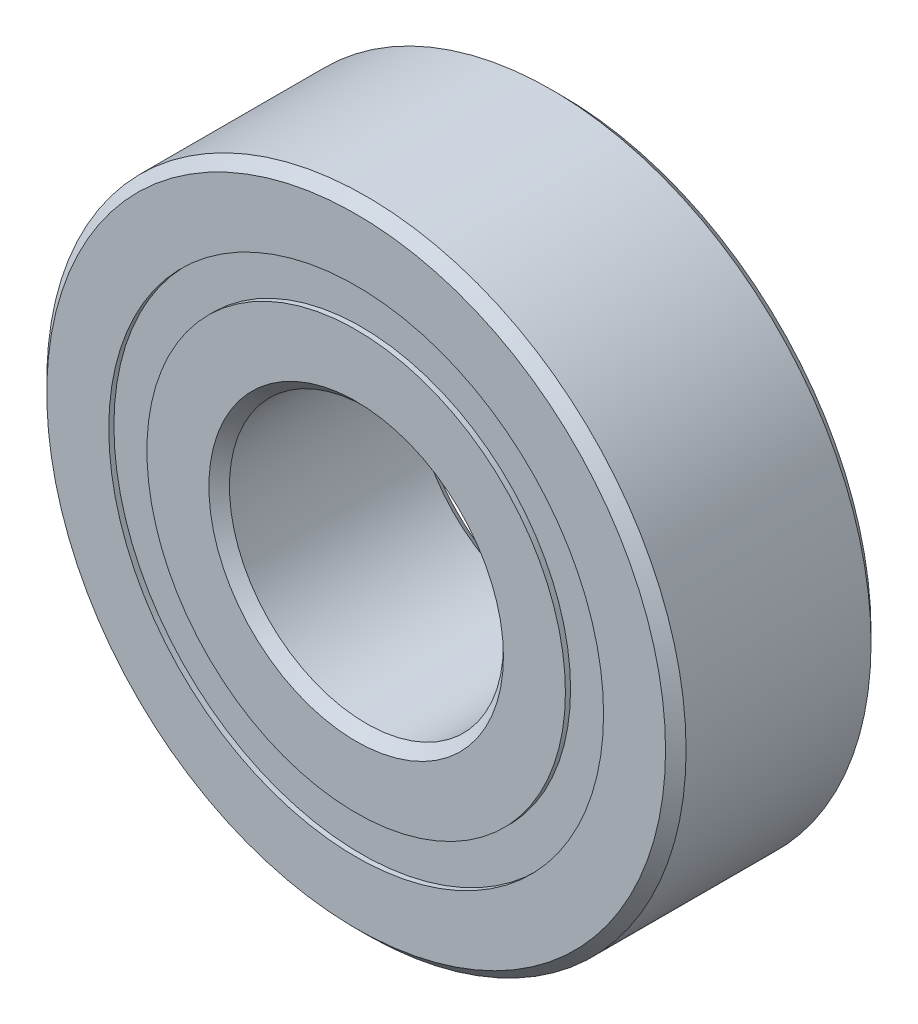
ISO-10303-21;
HEADER;
FILE_DESCRIPTION(('STEP AP214'),'2;1');
FILE_NAME('part.step','',(''),(''),'','','');
FILE_SCHEMA(('AUTOMOTIVE_DESIGN { 1 0 10303 214 1 1 1 1 }'));
ENDSEC;
DATA;
#1=APPLICATION_CONTEXT('core data for automotive mechanical design processes');
#2=APPLICATION_PROTOCOL_DEFINITION('international standard','automotive_design',2000,#1);
#3=PRODUCT_CONTEXT('',#1,'mechanical');
#4=PRODUCT('Part','Part','',(#3));
#5=PRODUCT_RELATED_PRODUCT_CATEGORY('part','',(#4));
#6=PRODUCT_DEFINITION_FORMATION('','',#4);
#7=PRODUCT_DEFINITION_CONTEXT('part definition',#1,'design');
#8=PRODUCT_DEFINITION('design','',#6,#7);
#9=PRODUCT_DEFINITION_SHAPE('','',#8);
#10=(LENGTH_UNIT() NAMED_UNIT(*) SI_UNIT(.MILLI.,.METRE.));
#11=(NAMED_UNIT(*) PLANE_ANGLE_UNIT() SI_UNIT($,.RADIAN.));
#12=(NAMED_UNIT(*) SI_UNIT($,.STERADIAN.) SOLID_ANGLE_UNIT());
#13=UNCERTAINTY_MEASURE_WITH_UNIT(LENGTH_MEASURE(1.E-05),#10,'distance_accuracy_value','');
#14=(GEOMETRIC_REPRESENTATION_CONTEXT(3) GLOBAL_UNCERTAINTY_ASSIGNED_CONTEXT((#13)) GLOBAL_UNIT_ASSIGNED_CONTEXT((#10,
#11,#12)) REPRESENTATION_CONTEXT('',''));
#15=CARTESIAN_POINT('',(0.,0.,0.));
#16=DIRECTION('',(0.,0.,1.));
#17=DIRECTION('',(1.,0.,0.));
#18=AXIS2_PLACEMENT_3D('',#15,#16,#17);
#19=CARTESIAN_POINT('',(0.,8.60041208791209,-3.39328125));
#20=DIRECTION('',(0.,0.,1.));
#21=DIRECTION('',(1.,0.,0.));
#22=AXIS2_PLACEMENT_3D('',#19,#20,#21);
#23=PLANE('',#22);
#24=CARTESIAN_POINT('',(0.,0.,-3.39328125));
#25=DIRECTION('',(0.,0.,1.));
#26=DIRECTION('',(1.,0.,0.));
#27=AXIS2_PLACEMENT_3D('',#24,#25,#26);
#28=CIRCLE('',#27,8.60041208791209);
#29=CARTESIAN_POINT('',(8.60041208791209,0.,-3.39328125));
#30=VERTEX_POINT('',#29);
#31=EDGE_CURVE('E57',#30,#30,#28,.T.);
#32=ORIENTED_EDGE('',*,*,#31,.F.);
#33=EDGE_LOOP('',(#32));
#34=FACE_BOUND('',#33,.T.);
#35=CARTESIAN_POINT('',(0.,0.,-3.39328125));
#36=DIRECTION('',(0.,0.,1.));
#37=DIRECTION('',(1.,0.,0.));
#38=AXIS2_PLACEMENT_3D('',#35,#36,#37);
#39=CIRCLE('',#38,7.27458791208791);
#40=CARTESIAN_POINT('',(7.27458791208791,0.,-3.39328125));
#41=VERTEX_POINT('',#40);
#42=EDGE_CURVE('E11',#41,#41,#39,.T.);
#43=ORIENTED_EDGE('',*,*,#42,.T.);
#44=EDGE_LOOP('',(#43));
#45=FACE_BOUND('',#44,.T.);
#46=ADVANCED_FACE('F43',(#34,#45),#23,.F.);
#47=CARTESIAN_POINT('',(0.,0.,3.571875));
#48=DIRECTION('',(0.,0.,1.));
#49=DIRECTION('',(1.,0.,0.));
#50=AXIS2_PLACEMENT_3D('',#47,#48,#49);
#51=CYLINDRICAL_SURFACE('',#50,7.27458791208791);
#52=ORIENTED_EDGE('',*,*,#42,.F.);
#53=EDGE_LOOP('',(#52));
#54=FACE_BOUND('',#53,.T.);
#55=CARTESIAN_POINT('',(0.,0.,-1.72035132641562));
#56=DIRECTION('',(0.,0.,1.));
#57=DIRECTION('',(1.,0.,0.));
#58=AXIS2_PLACEMENT_3D('',#55,#56,#57);
#59=CIRCLE('',#58,7.27458791208791);
#60=CARTESIAN_POINT('',(7.27458791208791,0.,-1.72035132641562));
#61=VERTEX_POINT('',#60);
#62=EDGE_CURVE('E49',#61,#61,#59,.T.);
#63=ORIENTED_EDGE('',*,*,#62,.T.);
#64=EDGE_LOOP('',(#63));
#65=FACE_BOUND('',#64,.T.);
#66=ADVANCED_FACE('F66',(#54,#65),#51,.F.);
#67=CARTESIAN_POINT('',(0.,8.60041208791209,-1.72035132641562));
#68=DIRECTION('',(0.,0.,-1.));
#69=DIRECTION('',(-1.,0.,0.));
#70=AXIS2_PLACEMENT_3D('',#67,#68,#69);
#71=PLANE('',#70);
#72=ORIENTED_EDGE('',*,*,#62,.F.);
#73=EDGE_LOOP('',(#72));
#74=FACE_BOUND('',#73,.T.);
#75=CARTESIAN_POINT('',(0.,0.,-1.72035132641562));
#76=DIRECTION('',(0.,0.,1.));
#77=DIRECTION('',(1.,0.,0.));
#78=AXIS2_PLACEMENT_3D('',#75,#76,#77);
#79=CIRCLE('',#78,8.60041208791209);
#80=CARTESIAN_POINT('',(8.60041208791209,0.,-1.72035132641562));
#81=VERTEX_POINT('',#80);
#82=EDGE_CURVE('E53',#81,#81,#79,.T.);
#83=ORIENTED_EDGE('',*,*,#82,.T.);
#84=EDGE_LOOP('',(#83));
#85=FACE_BOUND('',#84,.T.);
#86=ADVANCED_FACE('F70',(#74,#85),#71,.F.);
#87=CARTESIAN_POINT('',(0.,0.,3.571875));
#88=DIRECTION('',(0.,0.,1.));
#89=DIRECTION('',(1.,0.,0.));
#90=AXIS2_PLACEMENT_3D('',#87,#88,#89);
#91=CYLINDRICAL_SURFACE('',#90,8.60041208791209);
#92=ORIENTED_EDGE('',*,*,#82,.F.);
#93=EDGE_LOOP('',(#92));
#94=FACE_BOUND('',#93,.T.);
#95=ORIENTED_EDGE('',*,*,#31,.T.);
#96=EDGE_LOOP('',(#95));
#97=FACE_BOUND('',#96,.T.);
#98=ADVANCED_FACE('F63',(#94,#97),#91,.T.);
#99=CLOSED_SHELL('',(#46,#66,#86,#98));
#100=MANIFOLD_SOLID_BREP('B2',#99);
#101=CARTESIAN_POINT('',(0.,8.60041208791209,3.39328125));
#102=DIRECTION('',(0.,0.,-1.));
#103=DIRECTION('',(-1.,0.,0.));
#104=AXIS2_PLACEMENT_3D('',#101,#102,#103);
#105=PLANE('',#104);
#106=CARTESIAN_POINT('',(0.,0.,3.39328125));
#107=DIRECTION('',(0.,0.,1.));
#108=DIRECTION('',(1.,0.,0.));
#109=AXIS2_PLACEMENT_3D('',#106,#107,#108);
#110=CIRCLE('',#109,7.27458791208791);
#111=CARTESIAN_POINT('',(7.27458791208791,0.,3.39328125));
#112=VERTEX_POINT('',#111);
#113=EDGE_CURVE('E42',#112,#112,#110,.T.);
#114=ORIENTED_EDGE('',*,*,#113,.F.);
#115=EDGE_LOOP('',(#114));
#116=FACE_BOUND('',#115,.T.);
#117=CARTESIAN_POINT('',(0.,0.,3.39328125));
#118=DIRECTION('',(0.,0.,1.));
#119=DIRECTION('',(1.,0.,0.));
#120=AXIS2_PLACEMENT_3D('',#117,#118,#119);
#121=CIRCLE('',#120,8.60041208791209);
#122=CARTESIAN_POINT('',(8.60041208791209,0.,3.39328125));
#123=VERTEX_POINT('',#122);
#124=EDGE_CURVE('E124',#123,#123,#121,.T.);
#125=ORIENTED_EDGE('',*,*,#124,.T.);
#126=EDGE_LOOP('',(#125));
#127=FACE_BOUND('',#126,.T.);
#128=ADVANCED_FACE('F110',(#116,#127),#105,.F.);
#129=CARTESIAN_POINT('',(0.,0.,3.571875));
#130=DIRECTION('',(0.,0.,1.));
#131=DIRECTION('',(1.,0.,0.));
#132=AXIS2_PLACEMENT_3D('',#129,#130,#131);
#133=CYLINDRICAL_SURFACE('',#132,7.27458791208791);
#134=CARTESIAN_POINT('',(0.,0.,1.72035132641561));
#135=DIRECTION('',(0.,0.,1.));
#136=DIRECTION('',(1.,0.,0.));
#137=AXIS2_PLACEMENT_3D('',#134,#135,#136);
#138=CIRCLE('',#137,7.27458791208791);
#139=CARTESIAN_POINT('',(7.27458791208791,0.,1.72035132641561));
#140=VERTEX_POINT('',#139);
#141=EDGE_CURVE('E116',#140,#140,#138,.T.);
#142=ORIENTED_EDGE('',*,*,#141,.F.);
#143=EDGE_LOOP('',(#142));
#144=FACE_BOUND('',#143,.T.);
#145=ORIENTED_EDGE('',*,*,#113,.T.);
#146=EDGE_LOOP('',(#145));
#147=FACE_BOUND('',#146,.T.);
#148=ADVANCED_FACE('F139',(#144,#147),#133,.F.);
#149=CARTESIAN_POINT('',(0.,8.60041208791209,1.72035132641561));
#150=DIRECTION('',(0.,0.,1.));
#151=DIRECTION('',(1.,0.,0.));
#152=AXIS2_PLACEMENT_3D('',#149,#150,#151);
#153=PLANE('',#152);
#154=CARTESIAN_POINT('',(0.,0.,1.72035132641561));
#155=DIRECTION('',(0.,0.,1.));
#156=DIRECTION('',(1.,0.,0.));
#157=AXIS2_PLACEMENT_3D('',#154,#155,#156);
#158=CIRCLE('',#157,8.60041208791209);
#159=CARTESIAN_POINT('',(8.60041208791209,0.,1.72035132641561));
#160=VERTEX_POINT('',#159);
#161=EDGE_CURVE('E120',#160,#160,#158,.T.);
#162=ORIENTED_EDGE('',*,*,#161,.F.);
#163=EDGE_LOOP('',(#162));
#164=FACE_BOUND('',#163,.T.);
#165=ORIENTED_EDGE('',*,*,#141,.T.);
#166=EDGE_LOOP('',(#165));
#167=FACE_BOUND('',#166,.T.);
#168=ADVANCED_FACE('F134',(#164,#167),#153,.F.);
#169=CARTESIAN_POINT('',(0.,0.,3.571875));
#170=DIRECTION('',(0.,0.,1.));
#171=DIRECTION('',(1.,0.,0.));
#172=AXIS2_PLACEMENT_3D('',#169,#170,#171);
#173=CYLINDRICAL_SURFACE('',#172,8.60041208791209);
#174=ORIENTED_EDGE('',*,*,#124,.F.);
#175=EDGE_LOOP('',(#174));
#176=FACE_BOUND('',#175,.T.);
#177=ORIENTED_EDGE('',*,*,#161,.T.);
#178=EDGE_LOOP('',(#177));
#179=FACE_BOUND('',#178,.T.);
#180=ADVANCED_FACE('F131',(#176,#179),#173,.T.);
#181=CLOSED_SHELL('',(#128,#148,#168,#180));
#182=MANIFOLD_SOLID_BREP('B6',#181);
#183=CARTESIAN_POINT('',(-4.66554544007142,6.42157239285121,0.));
#184=DIRECTION('',(0.,0.,1.));
#185=DIRECTION('',(-0.587785252292462,0.809016994374955,0.));
#186=AXIS2_PLACEMENT_3D('',#183,#184,#185);
#187=SPHERICAL_SURFACE('',#186,1.72035132641561);
#188=CARTESIAN_POINT('',(-4.66554544007142,6.42157239285121,1.72035132641561));
#189=VERTEX_POINT('',#188);
#190=VERTEX_LOOP('',#189);
#191=FACE_BOUND('',#190,.T.);
#192=ADVANCED_FACE('F177',(#191),#187,.T.);
#193=CLOSED_SHELL('',(#192));
#194=MANIFOLD_SOLID_BREP('B37',#193);
#195=CARTESIAN_POINT('',(-7.54901109809275,2.45282239285123,0.));
#196=DIRECTION('',(0.,0.,1.));
#197=DIRECTION('',(-0.95105651629515,0.309016994374958,0.));
#198=AXIS2_PLACEMENT_3D('',#195,#196,#197);
#199=SPHERICAL_SURFACE('',#198,1.72035132641561);
#200=CARTESIAN_POINT('',(-7.54901109809275,2.45282239285123,1.72035132641561));
#201=VERTEX_POINT('',#200);
#202=VERTEX_LOOP('',#201);
#203=FACE_BOUND('',#202,.T.);
#204=ADVANCED_FACE('F197',(#203),#199,.T.);
#205=CLOSED_SHELL('',(#204));
#206=MANIFOLD_SOLID_BREP('B106',#205);
#207=CARTESIAN_POINT('',(-7.54901109809281,-2.45282239285107,0.));
#208=DIRECTION('',(0.,0.,1.));
#209=DIRECTION('',(-0.951056516295157,-0.309016994374938,0.));
#210=AXIS2_PLACEMENT_3D('',#207,#208,#209);
#211=SPHERICAL_SURFACE('',#210,1.72035132641561);
#212=CARTESIAN_POINT('',(-7.54901109809281,-2.45282239285107,1.72035132641561));
#213=VERTEX_POINT('',#212);
#214=VERTEX_LOOP('',#213);
#215=FACE_BOUND('',#214,.T.);
#216=ADVANCED_FACE('F217',(#215),#211,.T.);
#217=CLOSED_SHELL('',(#216));
#218=MANIFOLD_SOLID_BREP('B173',#217);
#219=CARTESIAN_POINT('',(-4.66554544007156,-6.4215723928511,0.));
#220=DIRECTION('',(0.,0.,1.));
#221=DIRECTION('',(-0.58778525229248,-0.809016994374942,0.));
#222=AXIS2_PLACEMENT_3D('',#219,#220,#221);
#223=SPHERICAL_SURFACE('',#222,1.72035132641561);
#224=CARTESIAN_POINT('',(-4.66554544007156,-6.4215723928511,1.72035132641561));
#225=VERTEX_POINT('',#224);
#226=VERTEX_LOOP('',#225);
#227=FACE_BOUND('',#226,.T.);
#228=ADVANCED_FACE('F237',(#227),#223,.T.);
#229=CLOSED_SHELL('',(#228));
#230=MANIFOLD_SOLID_BREP('B193',#229);
#231=CARTESIAN_POINT('',(0.,-7.9375,0.));
#232=DIRECTION('',(0.,0.,1.));
#233=DIRECTION('',(0.,-1.,0.));
#234=AXIS2_PLACEMENT_3D('',#231,#232,#233);
#235=SPHERICAL_SURFACE('',#234,1.72035132641561);
#236=CARTESIAN_POINT('',(0.,-7.9375,1.72035132641561));
#237=VERTEX_POINT('',#236);
#238=VERTEX_LOOP('',#237);
#239=FACE_BOUND('',#238,.T.);
#240=ADVANCED_FACE('F257',(#239),#235,.T.);
#241=CLOSED_SHELL('',(#240));
#242=MANIFOLD_SOLID_BREP('B213',#241);
#243=CARTESIAN_POINT('',(4.66554544007147,-6.42157239285117,0.));
#244=DIRECTION('',(0.,0.,1.));
#245=DIRECTION('',(0.587785252292469,-0.809016994374951,0.));
#246=AXIS2_PLACEMENT_3D('',#243,#244,#245);
#247=SPHERICAL_SURFACE('',#246,1.72035132641561);
#248=CARTESIAN_POINT('',(4.66554544007147,-6.42157239285117,1.72035132641561));
#249=VERTEX_POINT('',#248);
#250=VERTEX_LOOP('',#249);
#251=FACE_BOUND('',#250,.T.);
#252=ADVANCED_FACE('F277',(#251),#247,.T.);
#253=CLOSED_SHELL('',(#252));
#254=MANIFOLD_SOLID_BREP('B233',#253);
#255=CARTESIAN_POINT('',(7.54901109809277,-2.45282239285118,0.));
#256=DIRECTION('',(0.,0.,1.));
#257=DIRECTION('',(0.951056516295152,-0.309016994374952,0.));
#258=AXIS2_PLACEMENT_3D('',#255,#256,#257);
#259=SPHERICAL_SURFACE('',#258,1.72035132641561);
#260=CARTESIAN_POINT('',(7.54901109809277,-2.45282239285118,1.72035132641561));
#261=VERTEX_POINT('',#260);
#262=VERTEX_LOOP('',#261);
#263=FACE_BOUND('',#262,.T.);
#264=ADVANCED_FACE('F297',(#263),#259,.T.);
#265=CLOSED_SHELL('',(#264));
#266=MANIFOLD_SOLID_BREP('B253',#265);
#267=CARTESIAN_POINT('',(7.54901109809279,2.45282239285112,0.));
#268=DIRECTION('',(0.,0.,1.));
#269=DIRECTION('',(0.951056516295155,0.309016994374945,0.));
#270=AXIS2_PLACEMENT_3D('',#267,#268,#269);
#271=SPHERICAL_SURFACE('',#270,1.72035132641561);
#272=CARTESIAN_POINT('',(7.54901109809279,2.45282239285112,1.72035132641561));
#273=VERTEX_POINT('',#272);
#274=VERTEX_LOOP('',#273);
#275=FACE_BOUND('',#274,.T.);
#276=ADVANCED_FACE('F318',(#275),#271,.T.);
#277=CLOSED_SHELL('',(#276));
#278=MANIFOLD_SOLID_BREP('B273',#277);
#279=CARTESIAN_POINT('',(4.66554544007152,6.42157239285114,0.));
#280=DIRECTION('',(0.,0.,1.));
#281=DIRECTION('',(0.587785252292474,0.809016994374947,0.));
#282=AXIS2_PLACEMENT_3D('',#279,#280,#281);
#283=SPHERICAL_SURFACE('',#282,1.72035132641561);
#284=CARTESIAN_POINT('',(4.66554544007152,6.42157239285114,1.72035132641561));
#285=VERTEX_POINT('',#284);
#286=VERTEX_LOOP('',#285);
#287=FACE_BOUND('',#286,.T.);
#288=ADVANCED_FACE('F341',(#287),#283,.T.);
#289=CLOSED_SHELL('',(#288));
#290=MANIFOLD_SOLID_BREP('B293',#289);
#291=CARTESIAN_POINT('',(0.,7.9375,0.));
#292=DIRECTION('',(0.,0.,1.));
#293=DIRECTION('',(0.,1.,0.));
#294=AXIS2_PLACEMENT_3D('',#291,#292,#293);
#295=SPHERICAL_SURFACE('',#294,1.72035132641561);
#296=CARTESIAN_POINT('',(0.,7.9375,1.72035132641561));
#297=VERTEX_POINT('',#296);
#298=VERTEX_LOOP('',#297);
#299=FACE_BOUND('',#298,.T.);
#300=ADVANCED_FACE('F364',(#299),#295,.T.);
#301=CLOSED_SHELL('',(#300));
#302=MANIFOLD_SOLID_BREP('B314',#301);
#303=CARTESIAN_POINT('',(0.,7.27458791208791,3.571875));
#304=DIRECTION('',(0.,0.,-1.));
#305=DIRECTION('',(-1.,0.,0.));
#306=AXIS2_PLACEMENT_3D('',#303,#304,#305);
#307=PLANE('',#306);
#308=CARTESIAN_POINT('',(0.,0.,3.571875));
#309=DIRECTION('',(0.,0.,1.));
#310=DIRECTION('',(1.,0.,0.));
#311=AXIS2_PLACEMENT_3D('',#308,#309,#310);
#312=CIRCLE('',#311,5.1196875);
#313=CARTESIAN_POINT('',(5.1196875,0.,3.571875));
#314=VERTEX_POINT('',#313);
#315=EDGE_CURVE('E415',#314,#314,#312,.T.);
#316=ORIENTED_EDGE('',*,*,#315,.F.);
#317=EDGE_LOOP('',(#316));
#318=FACE_BOUND('',#317,.T.);
#319=CARTESIAN_POINT('',(0.,0.,3.571875));
#320=DIRECTION('',(0.,0.,1.));
#321=DIRECTION('',(1.,0.,0.));
#322=AXIS2_PLACEMENT_3D('',#319,#320,#321);
#323=CIRCLE('',#322,7.27458791208791);
#324=CARTESIAN_POINT('',(7.27458791208791,0.,3.571875));
#325=VERTEX_POINT('',#324);
#326=EDGE_CURVE('E363',#325,#325,#323,.T.);
#327=ORIENTED_EDGE('',*,*,#326,.T.);
#328=EDGE_LOOP('',(#327));
#329=FACE_BOUND('',#328,.T.);
#330=ADVANCED_FACE('F387',(#318,#329),#307,.F.);
#331=CARTESIAN_POINT('',(0.,0.,3.571875));
#332=DIRECTION('',(0.,0.,1.));
#333=DIRECTION('',(1.,0.,0.));
#334=AXIS2_PLACEMENT_3D('',#331,#332,#333);
#335=CYLINDRICAL_SURFACE('',#334,7.27458791208791);
#336=ORIENTED_EDGE('',*,*,#326,.F.);
#337=EDGE_LOOP('',(#336));
#338=FACE_BOUND('',#337,.T.);
#339=CARTESIAN_POINT('',(0.,0.,1.5875));
#340=DIRECTION('',(0.,0.,1.));
#341=DIRECTION('',(1.,0.,0.));
#342=AXIS2_PLACEMENT_3D('',#339,#340,#341);
#343=CIRCLE('',#342,7.27458791208791);
#344=CARTESIAN_POINT('',(7.27458791208791,0.,1.5875));
#345=VERTEX_POINT('',#344);
#346=EDGE_CURVE('E393',#345,#345,#343,.T.);
#347=ORIENTED_EDGE('',*,*,#346,.T.);
#348=EDGE_LOOP('',(#347));
#349=FACE_BOUND('',#348,.T.);
#350=ADVANCED_FACE('F422',(#338,#349),#335,.T.);
#351=CARTESIAN_POINT('',(0.,0.,0.));
#352=DIRECTION('',(0.,0.,1.));
#353=DIRECTION('',(1.,0.,0.));
#354=AXIS2_PLACEMENT_3D('',#351,#352,#353);
#355=TOROIDAL_SURFACE('',#354,7.93749999999999,1.72035132641561);
#356=ORIENTED_EDGE('',*,*,#346,.F.);
#357=EDGE_LOOP('',(#356));
#358=FACE_BOUND('',#357,.T.);
#359=CARTESIAN_POINT('',(0.,0.,-1.5875));
#360=DIRECTION('',(0.,0.,1.));
#361=DIRECTION('',(1.,0.,0.));
#362=AXIS2_PLACEMENT_3D('',#359,#360,#361);
#363=CIRCLE('',#362,7.27458791208791);
#364=CARTESIAN_POINT('',(7.27458791208791,0.,-1.5875));
#365=VERTEX_POINT('',#364);
#366=EDGE_CURVE('E397',#365,#365,#363,.T.);
#367=ORIENTED_EDGE('',*,*,#366,.T.);
#368=EDGE_LOOP('',(#367));
#369=FACE_BOUND('',#368,.T.);
#370=ADVANCED_FACE('F426',(#358,#369),#355,.F.);
#371=CARTESIAN_POINT('',(0.,0.,3.571875));
#372=DIRECTION('',(0.,0.,1.));
#373=DIRECTION('',(1.,0.,0.));
#374=AXIS2_PLACEMENT_3D('',#371,#372,#373);
#375=CYLINDRICAL_SURFACE('',#374,7.27458791208791);
#376=ORIENTED_EDGE('',*,*,#366,.F.);
#377=EDGE_LOOP('',(#376));
#378=FACE_BOUND('',#377,.T.);
#379=CARTESIAN_POINT('',(0.,0.,-3.571875));
#380=DIRECTION('',(0.,0.,1.));
#381=DIRECTION('',(1.,0.,0.));
#382=AXIS2_PLACEMENT_3D('',#379,#380,#381);
#383=CIRCLE('',#382,7.27458791208791);
#384=CARTESIAN_POINT('',(7.27458791208791,0.,-3.571875));
#385=VERTEX_POINT('',#384);
#386=EDGE_CURVE('E401',#385,#385,#383,.T.);
#387=ORIENTED_EDGE('',*,*,#386,.T.);
#388=EDGE_LOOP('',(#387));
#389=FACE_BOUND('',#388,.T.);
#390=ADVANCED_FACE('F431',(#378,#389),#375,.T.);
#391=CARTESIAN_POINT('',(0.,5.1196875,-3.571875));
#392=DIRECTION('',(0.,0.,1.));
#393=DIRECTION('',(1.,0.,0.));
#394=AXIS2_PLACEMENT_3D('',#391,#392,#393);
#395=PLANE('',#394);
#396=ORIENTED_EDGE('',*,*,#386,.F.);
#397=EDGE_LOOP('',(#396));
#398=FACE_BOUND('',#397,.T.);
#399=CARTESIAN_POINT('',(0.,0.,-3.571875));
#400=DIRECTION('',(0.,0.,1.));
#401=DIRECTION('',(1.,0.,0.));
#402=AXIS2_PLACEMENT_3D('',#399,#400,#401);
#403=CIRCLE('',#402,5.1196875);
#404=CARTESIAN_POINT('',(5.1196875,0.,-3.571875));
#405=VERTEX_POINT('',#404);
#406=EDGE_CURVE('E406',#405,#405,#403,.T.);
#407=ORIENTED_EDGE('',*,*,#406,.T.);
#408=EDGE_LOOP('',(#407));
#409=FACE_BOUND('',#408,.T.);
#410=ADVANCED_FACE('F437',(#398,#409),#395,.F.);
#411=CARTESIAN_POINT('',(0.,0.,-3.2146875));
#412=DIRECTION('',(0.,0.,-1.));
#413=DIRECTION('',(-1.,0.,0.));
#414=AXIS2_PLACEMENT_3D('',#411,#412,#413);
#415=CONICAL_SURFACE('',#414,4.7625,0.785398163397444);
#416=ORIENTED_EDGE('',*,*,#406,.F.);
#417=EDGE_LOOP('',(#416));
#418=FACE_BOUND('',#417,.T.);
#419=CARTESIAN_POINT('',(0.,0.,-3.2146875));
#420=DIRECTION('',(0.,0.,1.));
#421=DIRECTION('',(1.,0.,0.));
#422=AXIS2_PLACEMENT_3D('',#419,#420,#421);
#423=CIRCLE('',#422,4.7625);
#424=CARTESIAN_POINT('',(4.7625,0.,-3.2146875));
#425=VERTEX_POINT('',#424);
#426=EDGE_CURVE('E409',#425,#425,#423,.T.);
#427=ORIENTED_EDGE('',*,*,#426,.T.);
#428=EDGE_LOOP('',(#427));
#429=FACE_BOUND('',#428,.T.);
#430=ADVANCED_FACE('F441',(#418,#429),#415,.F.);
#431=CARTESIAN_POINT('',(0.,0.,3.571875));
#432=DIRECTION('',(0.,0.,1.));
#433=DIRECTION('',(1.,0.,0.));
#434=AXIS2_PLACEMENT_3D('',#431,#432,#433);
#435=CYLINDRICAL_SURFACE('',#434,4.7625);
#436=ORIENTED_EDGE('',*,*,#426,.F.);
#437=EDGE_LOOP('',(#436));
#438=FACE_BOUND('',#437,.T.);
#439=CARTESIAN_POINT('',(0.,0.,3.2146875));
#440=DIRECTION('',(0.,0.,1.));
#441=DIRECTION('',(1.,0.,0.));
#442=AXIS2_PLACEMENT_3D('',#439,#440,#441);
#443=CIRCLE('',#442,4.7625);
#444=CARTESIAN_POINT('',(4.7625,0.,3.2146875));
#445=VERTEX_POINT('',#444);
#446=EDGE_CURVE('E412',#445,#445,#443,.T.);
#447=ORIENTED_EDGE('',*,*,#446,.T.);
#448=EDGE_LOOP('',(#447));
#449=FACE_BOUND('',#448,.T.);
#450=ADVANCED_FACE('F445',(#438,#449),#435,.F.);
#451=CARTESIAN_POINT('',(0.,0.,3.571875));
#452=DIRECTION('',(0.,0.,1.));
#453=DIRECTION('',(1.,0.,0.));
#454=AXIS2_PLACEMENT_3D('',#451,#452,#453);
#455=CONICAL_SURFACE('',#454,5.1196875,0.785398163397453);
#456=ORIENTED_EDGE('',*,*,#446,.F.);
#457=EDGE_LOOP('',(#456));
#458=FACE_BOUND('',#457,.T.);
#459=ORIENTED_EDGE('',*,*,#315,.T.);
#460=EDGE_LOOP('',(#459));
#461=FACE_BOUND('',#460,.T.);
#462=ADVANCED_FACE('F419',(#458,#461),#455,.F.);
#463=CLOSED_SHELL('',(#330,#350,#370,#390,#410,#430,#450,#462));
#464=MANIFOLD_SOLID_BREP('B337',#463);
#465=CARTESIAN_POINT('',(0.,0.,3.2146875));
#466=DIRECTION('',(0.,0.,-1.));
#467=DIRECTION('',(-1.,0.,0.));
#468=AXIS2_PLACEMENT_3D('',#465,#466,#467);
#469=CONICAL_SURFACE('',#468,11.1125,0.785398163397446);
#470=CARTESIAN_POINT('',(0.,0.,3.571875));
#471=DIRECTION('',(0.,0.,1.));
#472=DIRECTION('',(1.,0.,0.));
#473=AXIS2_PLACEMENT_3D('',#470,#471,#472);
#474=CIRCLE('',#473,10.7553125);
#475=CARTESIAN_POINT('',(10.7553125,0.,3.571875));
#476=VERTEX_POINT('',#475);
#477=EDGE_CURVE('E539',#476,#476,#474,.T.);
#478=ORIENTED_EDGE('',*,*,#477,.F.);
#479=EDGE_LOOP('',(#478));
#480=FACE_BOUND('',#479,.T.);
#481=CARTESIAN_POINT('',(0.,0.,3.2146875));
#482=DIRECTION('',(0.,0.,1.));
#483=DIRECTION('',(1.,0.,0.));
#484=AXIS2_PLACEMENT_3D('',#481,#482,#483);
#485=CIRCLE('',#484,11.1125);
#486=CARTESIAN_POINT('',(11.1125,0.,3.2146875));
#487=VERTEX_POINT('',#486);
#488=EDGE_CURVE('E386',#487,#487,#485,.T.);
#489=ORIENTED_EDGE('',*,*,#488,.T.);
#490=EDGE_LOOP('',(#489));
#491=FACE_BOUND('',#490,.T.);
#492=ADVANCED_FACE('F511',(#480,#491),#469,.T.);
#493=CARTESIAN_POINT('',(0.,0.,3.571875));
#494=DIRECTION('',(0.,0.,1.));
#495=DIRECTION('',(1.,0.,0.));
#496=AXIS2_PLACEMENT_3D('',#493,#494,#495);
#497=CYLINDRICAL_SURFACE('',#496,11.1125);
#498=ORIENTED_EDGE('',*,*,#488,.F.);
#499=EDGE_LOOP('',(#498));
#500=FACE_BOUND('',#499,.T.);
#501=CARTESIAN_POINT('',(0.,0.,-3.2146875));
#502=DIRECTION('',(0.,0.,1.));
#503=DIRECTION('',(1.,0.,0.));
#504=AXIS2_PLACEMENT_3D('',#501,#502,#503);
#505=CIRCLE('',#504,11.1125);
#506=CARTESIAN_POINT('',(11.1125,0.,-3.2146875));
#507=VERTEX_POINT('',#506);
#508=EDGE_CURVE('E517',#507,#507,#505,.T.);
#509=ORIENTED_EDGE('',*,*,#508,.T.);
#510=EDGE_LOOP('',(#509));
#511=FACE_BOUND('',#510,.T.);
#512=ADVANCED_FACE('F546',(#500,#511),#497,.T.);
#513=CARTESIAN_POINT('',(0.,0.,-3.571875));
#514=DIRECTION('',(0.,0.,1.));
#515=DIRECTION('',(1.,0.,0.));
#516=AXIS2_PLACEMENT_3D('',#513,#514,#515);
#517=CONICAL_SURFACE('',#516,10.7553125,0.785398163397444);
#518=ORIENTED_EDGE('',*,*,#508,.F.);
#519=EDGE_LOOP('',(#518));
#520=FACE_BOUND('',#519,.T.);
#521=CARTESIAN_POINT('',(0.,0.,-3.571875));
#522=DIRECTION('',(0.,0.,1.));
#523=DIRECTION('',(1.,0.,0.));
#524=AXIS2_PLACEMENT_3D('',#521,#522,#523);
#525=CIRCLE('',#524,10.7553125);
#526=CARTESIAN_POINT('',(10.7553125,0.,-3.571875));
#527=VERTEX_POINT('',#526);
#528=EDGE_CURVE('E521',#527,#527,#525,.T.);
#529=ORIENTED_EDGE('',*,*,#528,.T.);
#530=EDGE_LOOP('',(#529));
#531=FACE_BOUND('',#530,.T.);
#532=ADVANCED_FACE('F550',(#520,#531),#517,.T.);
#533=CARTESIAN_POINT('',(0.,10.7553125,-3.571875));
#534=DIRECTION('',(0.,0.,1.));
#535=DIRECTION('',(1.,0.,0.));
#536=AXIS2_PLACEMENT_3D('',#533,#534,#535);
#537=PLANE('',#536);
#538=ORIENTED_EDGE('',*,*,#528,.F.);
#539=EDGE_LOOP('',(#538));
#540=FACE_BOUND('',#539,.T.);
#541=CARTESIAN_POINT('',(0.,0.,-3.571875));
#542=DIRECTION('',(0.,0.,1.));
#543=DIRECTION('',(1.,0.,0.));
#544=AXIS2_PLACEMENT_3D('',#541,#542,#543);
#545=CIRCLE('',#544,8.60041208791209);
#546=CARTESIAN_POINT('',(8.60041208791209,0.,-3.571875));
#547=VERTEX_POINT('',#546);
#548=EDGE_CURVE('E525',#547,#547,#545,.T.);
#549=ORIENTED_EDGE('',*,*,#548,.T.);
#550=EDGE_LOOP('',(#549));
#551=FACE_BOUND('',#550,.T.);
#552=ADVANCED_FACE('F555',(#540,#551),#537,.F.);
#553=CARTESIAN_POINT('',(0.,0.,3.571875));
#554=DIRECTION('',(0.,0.,1.));
#555=DIRECTION('',(1.,0.,0.));
#556=AXIS2_PLACEMENT_3D('',#553,#554,#555);
#557=CYLINDRICAL_SURFACE('',#556,8.60041208791209);
#558=ORIENTED_EDGE('',*,*,#548,.F.);
#559=EDGE_LOOP('',(#558));
#560=FACE_BOUND('',#559,.T.);
#561=CARTESIAN_POINT('',(0.,0.,-1.5875));
#562=DIRECTION('',(0.,0.,1.));
#563=DIRECTION('',(1.,0.,0.));
#564=AXIS2_PLACEMENT_3D('',#561,#562,#563);
#565=CIRCLE('',#564,8.60041208791209);
#566=CARTESIAN_POINT('',(8.60041208791209,0.,-1.5875));
#567=VERTEX_POINT('',#566);
#568=EDGE_CURVE('E530',#567,#567,#565,.T.);
#569=ORIENTED_EDGE('',*,*,#568,.T.);
#570=EDGE_LOOP('',(#569));
#571=FACE_BOUND('',#570,.T.);
#572=ADVANCED_FACE('F561',(#560,#571),#557,.F.);
#573=CARTESIAN_POINT('',(0.,0.,0.));
#574=DIRECTION('',(0.,0.,1.));
#575=DIRECTION('',(1.,0.,0.));
#576=AXIS2_PLACEMENT_3D('',#573,#574,#575);
#577=TOROIDAL_SURFACE('',#576,7.9375,1.72035132641561);
#578=ORIENTED_EDGE('',*,*,#568,.F.);
#579=EDGE_LOOP('',(#578));
#580=FACE_BOUND('',#579,.T.);
#581=CARTESIAN_POINT('',(0.,0.,1.5875));
#582=DIRECTION('',(0.,0.,1.));
#583=DIRECTION('',(1.,0.,0.));
#584=AXIS2_PLACEMENT_3D('',#581,#582,#583);
#585=CIRCLE('',#584,8.60041208791209);
#586=CARTESIAN_POINT('',(8.60041208791209,0.,1.5875));
#587=VERTEX_POINT('',#586);
#588=EDGE_CURVE('E533',#587,#587,#585,.T.);
#589=ORIENTED_EDGE('',*,*,#588,.T.);
#590=EDGE_LOOP('',(#589));
#591=FACE_BOUND('',#590,.T.);
#592=ADVANCED_FACE('F565',(#580,#591),#577,.F.);
#593=CARTESIAN_POINT('',(0.,0.,3.571875));
#594=DIRECTION('',(0.,0.,1.));
#595=DIRECTION('',(1.,0.,0.));
#596=AXIS2_PLACEMENT_3D('',#593,#594,#595);
#597=CYLINDRICAL_SURFACE('',#596,8.60041208791209);
#598=ORIENTED_EDGE('',*,*,#588,.F.);
#599=EDGE_LOOP('',(#598));
#600=FACE_BOUND('',#599,.T.);
#601=CARTESIAN_POINT('',(0.,0.,3.571875));
#602=DIRECTION('',(0.,0.,1.));
#603=DIRECTION('',(1.,0.,0.));
#604=AXIS2_PLACEMENT_3D('',#601,#602,#603);
#605=CIRCLE('',#604,8.60041208791209);
#606=CARTESIAN_POINT('',(8.60041208791209,0.,3.571875));
#607=VERTEX_POINT('',#606);
#608=EDGE_CURVE('E536',#607,#607,#605,.T.);
#609=ORIENTED_EDGE('',*,*,#608,.T.);
#610=EDGE_LOOP('',(#609));
#611=FACE_BOUND('',#610,.T.);
#612=ADVANCED_FACE('F569',(#600,#611),#597,.F.);
#613=CARTESIAN_POINT('',(0.,10.7553125,3.571875));
#614=DIRECTION('',(0.,0.,-1.));
#615=DIRECTION('',(-1.,0.,0.));
#616=AXIS2_PLACEMENT_3D('',#613,#614,#615);
#617=PLANE('',#616);
#618=ORIENTED_EDGE('',*,*,#608,.F.);
#619=EDGE_LOOP('',(#618));
#620=FACE_BOUND('',#619,.T.);
#621=ORIENTED_EDGE('',*,*,#477,.T.);
#622=EDGE_LOOP('',(#621));
#623=FACE_BOUND('',#622,.T.);
#624=ADVANCED_FACE('F543',(#620,#623),#617,.F.);
#625=CLOSED_SHELL('',(#492,#512,#532,#552,#572,#592,#612,#624));
#626=MANIFOLD_SOLID_BREP('B358',#625);
#627=ADVANCED_BREP_SHAPE_REPRESENTATION('',(#18,#100,#182,#194,#206,#218,#230,#242,#254,#266,
#278,#290,#302,#464,#626),#14);
#628=SHAPE_DEFINITION_REPRESENTATION(#9,#627);
ENDSEC;
END-ISO-10303-21;
